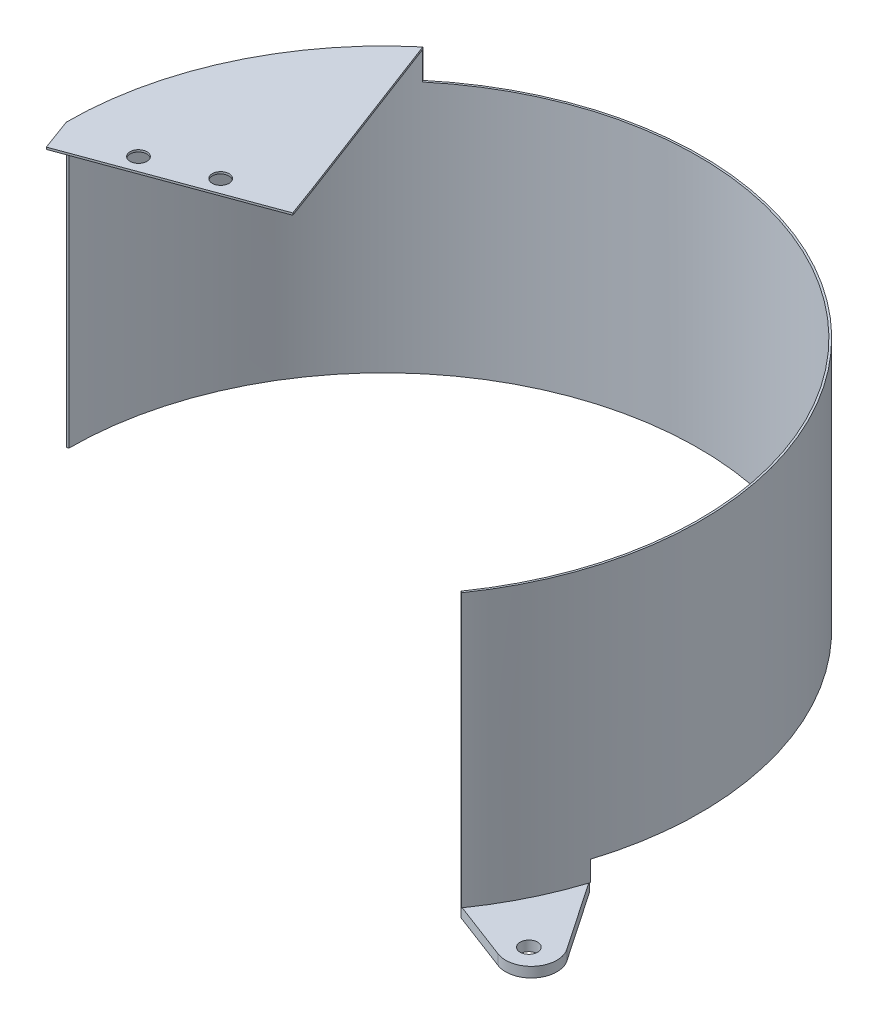
ISO-10303-21;
HEADER;
FILE_DESCRIPTION(('STEP AP214'),'2;1');
FILE_NAME('part.step','',(''),(''),'','','');
FILE_SCHEMA(('AUTOMOTIVE_DESIGN { 1 0 10303 214 1 1 1 1 }'));
ENDSEC;
DATA;
#1=APPLICATION_CONTEXT('core data for automotive mechanical design processes');
#2=APPLICATION_PROTOCOL_DEFINITION('international standard','automotive_design',2000,#1);
#3=PRODUCT_CONTEXT('',#1,'mechanical');
#4=PRODUCT('Part','Part','',(#3));
#5=PRODUCT_RELATED_PRODUCT_CATEGORY('part','',(#4));
#6=PRODUCT_DEFINITION_FORMATION('','',#4);
#7=PRODUCT_DEFINITION_CONTEXT('part definition',#1,'design');
#8=PRODUCT_DEFINITION('design','',#6,#7);
#9=PRODUCT_DEFINITION_SHAPE('','',#8);
#10=(LENGTH_UNIT() NAMED_UNIT(*) SI_UNIT(.MILLI.,.METRE.));
#11=(NAMED_UNIT(*) PLANE_ANGLE_UNIT() SI_UNIT($,.RADIAN.));
#12=(NAMED_UNIT(*) SI_UNIT($,.STERADIAN.) SOLID_ANGLE_UNIT());
#13=UNCERTAINTY_MEASURE_WITH_UNIT(LENGTH_MEASURE(1.E-05),#10,'distance_accuracy_value','');
#14=(GEOMETRIC_REPRESENTATION_CONTEXT(3) GLOBAL_UNCERTAINTY_ASSIGNED_CONTEXT((#13)) GLOBAL_UNIT_ASSIGNED_CONTEXT((#10,
#11,#12)) REPRESENTATION_CONTEXT('',''));
#15=CARTESIAN_POINT('',(0.,0.,0.));
#16=DIRECTION('',(0.,0.,1.));
#17=DIRECTION('',(1.,0.,0.));
#18=AXIS2_PLACEMENT_3D('',#15,#16,#17);
#19=CARTESIAN_POINT('',(0.,0.,0.));
#20=DIRECTION('',(0.,1.,0.));
#21=DIRECTION('',(1.,0.,0.));
#22=AXIS2_PLACEMENT_3D('',#19,#20,#21);
#23=PLANE('',#22);
#24=DIRECTION('',(-0.934811028773675,0.,-0.355145520150688));
#25=VECTOR('',#24,1.);
#26=CARTESIAN_POINT('',(97.186983651397,0.,68.0510585685711));
#27=LINE('',#26,#25);
#28=CARTESIAN_POINT('',(97.8971203298986,0.,68.3208477048796));
#29=VERTEX_POINT('',#28);
#30=CARTESIAN_POINT('',(97.186983651397,0.,68.0510585685711));
#31=VERTEX_POINT('',#30);
#32=EDGE_CURVE('E11',#29,#31,#27,.T.);
#33=ORIENTED_EDGE('',*,*,#32,.F.);
#34=CARTESIAN_POINT('',(0.,0.,0.));
#35=DIRECTION('',(0.,-1.,0.));
#36=DIRECTION('',(0.,0.,-1.));
#37=AXIS2_PLACEMENT_3D('',#34,#35,#36);
#38=CIRCLE('',#37,119.38);
#39=CARTESIAN_POINT('',(97.7903710472203,0.,68.4735549715873));
#40=VERTEX_POINT('',#39);
#41=EDGE_CURVE('E277',#29,#40,#38,.T.);
#42=ORIENTED_EDGE('',*,*,#41,.T.);
#43=DIRECTION('',(-0.819152044289029,0.,-0.573576436350992));
#44=VECTOR('',#43,1.);
#45=CARTESIAN_POINT('',(97.7903710472203,0.,68.4735549715873));
#46=LINE('',#45,#44);
#47=EDGE_CURVE('E265',#40,#31,#46,.T.);
#48=ORIENTED_EDGE('',*,*,#47,.T.);
#49=EDGE_LOOP('',(#33,#42,#48));
#50=FACE_BOUND('',#49,.T.);
#51=ADVANCED_FACE('F37',(#50),#23,.F.);
#52=DIRECTION('',(0.562477705268129,0.,0.82681245217782));
#53=VECTOR('',#52,1.);
#54=CARTESIAN_POINT('',(113.152221674402,0.,35.6767584529049));
#55=LINE('',#54,#53);
#56=CARTESIAN_POINT('',(113.152221674402,0.,35.6767584529049));
#57=VERTEX_POINT('',#56);
#58=CARTESIAN_POINT('',(113.678961298853,0.,36.4510378180639));
#59=VERTEX_POINT('',#58);
#60=EDGE_CURVE('E356',#57,#59,#55,.T.);
#61=ORIENTED_EDGE('',*,*,#60,.F.);
#62=DIRECTION('',(-0.953716950748228,0.,-0.30070579950427));
#63=VECTOR('',#62,1.);
#64=CARTESIAN_POINT('',(113.152221674402,0.,35.6767584529049));
#65=LINE('',#64,#63);
#66=CARTESIAN_POINT('',(113.854729580324,0.,35.8982583448194));
#67=VERTEX_POINT('',#66);
#68=EDGE_CURVE('E257',#57,#67,#65,.F.);
#69=ORIENTED_EDGE('',*,*,#68,.T.);
#70=EDGE_CURVE('E270',#67,#59,#38,.T.);
#71=ORIENTED_EDGE('',*,*,#70,.T.);
#72=EDGE_LOOP('',(#61,#69,#71));
#73=FACE_BOUND('',#72,.T.);
#74=ADVANCED_FACE('F383',(#73),#23,.F.);
#75=CARTESIAN_POINT('',(-119.379693575983,7.61999999999996,0.2704842037125));
#76=DIRECTION('',(0.344827586206966,0.,0.938666040607988));
#77=DIRECTION('',(0.938666040607988,0.,-0.344827586206966));
#78=AXIS2_PLACEMENT_3D('',#75,#76,#77);
#79=PLANE('',#78);
#80=DIRECTION('',(0.,-1.,0.));
#81=VECTOR('',#80,1.);
#82=CARTESIAN_POINT('',(-118.6434,102.87,0.));
#83=LINE('',#82,#81);
#84=CARTESIAN_POINT('',(-118.6434,113.03,0.));
#85=VERTEX_POINT('',#84);
#86=CARTESIAN_POINT('',(-118.6434,7.61999999999996,0.));
#87=VERTEX_POINT('',#86);
#88=EDGE_CURVE('E275',#85,#87,#83,.T.);
#89=ORIENTED_EDGE('',*,*,#88,.F.);
#90=DIRECTION('',(0.938666040607988,0.,-0.344827586206966));
#91=VECTOR('',#90,1.);
#92=CARTESIAN_POINT('',(-119.379693575983,113.03,0.270484203712493));
#93=LINE('',#92,#91);
#94=CARTESIAN_POINT('',(-119.379693575983,113.03,0.2704842037125));
#95=VERTEX_POINT('',#94);
#96=EDGE_CURVE('E61',#95,#85,#93,.T.);
#97=ORIENTED_EDGE('',*,*,#96,.F.);
#98=DIRECTION('',(0.,1.,0.));
#99=VECTOR('',#98,1.);
#100=CARTESIAN_POINT('',(-119.379693575983,7.61999999999996,0.2704842037125));
#101=LINE('',#100,#99);
#102=CARTESIAN_POINT('',(-119.379693575983,7.61999999999996,0.2704842037125));
#103=VERTEX_POINT('',#102);
#104=EDGE_CURVE('E251',#103,#95,#101,.T.);
#105=ORIENTED_EDGE('',*,*,#104,.F.);
#106=DIRECTION('',(0.938666040607988,0.,-0.344827586206966));
#107=VECTOR('',#106,1.);
#108=CARTESIAN_POINT('',(-119.379693575983,7.61999999999996,0.2704842037125));
#109=LINE('',#108,#107);
#110=EDGE_CURVE('E248',#103,#87,#109,.T.);
#111=ORIENTED_EDGE('',*,*,#110,.T.);
#112=EDGE_LOOP('',(#89,#97,#105,#111));
#113=FACE_BOUND('',#112,.T.);
#114=ADVANCED_FACE('F388',(#113),#79,.T.);
#115=CARTESIAN_POINT('',(-8.68307739513456E-12,113.03,-4.05590009722013E-12));
#116=DIRECTION('',(0.,-1.,0.));
#117=DIRECTION('',(0.,0.,-1.));
#118=AXIS2_PLACEMENT_3D('',#115,#116,#117);
#119=PLANE('',#118);
#120=DIRECTION('',(-0.354304631179803,0.,-0.935130059577032));
#121=VECTOR('',#120,1.);
#122=CARTESIAN_POINT('',(-51.440692330775,113.03,-24.6875315284033));
#123=LINE('',#122,#121);
#124=CARTESIAN_POINT('',(-76.4594448936933,113.03,-90.7205029202786));
#125=VERTEX_POINT('',#124);
#126=CARTESIAN_POINT('',(-76.7359848443851,113.03,-91.4503856195385));
#127=VERTEX_POINT('',#126);
#128=EDGE_CURVE('E46',#125,#127,#123,.T.);
#129=ORIENTED_EDGE('',*,*,#128,.F.);
#130=CARTESIAN_POINT('',(-8.68307739513456E-12,113.03,-4.05590009722013E-12));
#131=DIRECTION('',(0.,-1.,0.));
#132=DIRECTION('',(0.,0.,-1.));
#133=AXIS2_PLACEMENT_3D('',#130,#131,#132);
#134=CIRCLE('',#133,118.643399999991);
#135=CARTESIAN_POINT('',(-76.26250749109,113.03,-90.8861172827371));
#136=VERTEX_POINT('',#135);
#137=EDGE_CURVE('E237',#125,#136,#134,.T.);
#138=ORIENTED_EDGE('',*,*,#137,.T.);
#139=DIRECTION('',(-0.642787609686567,0.,-0.766044443118955));
#140=VECTOR('',#139,1.);
#141=CARTESIAN_POINT('',(-76.7359848443851,113.03,-91.4503856195385));
#142=LINE('',#141,#140);
#143=EDGE_CURVE('E236',#136,#127,#142,.T.);
#144=ORIENTED_EDGE('',*,*,#143,.T.);
#145=EDGE_LOOP('',(#129,#138,#144));
#146=FACE_BOUND('',#145,.T.);
#147=ADVANCED_FACE('F329',(#146),#119,.F.);
#148=CARTESIAN_POINT('',(0.,102.87,0.));
#149=DIRECTION('',(0.,-1.,0.));
#150=DIRECTION('',(0.,0.,-1.));
#151=AXIS2_PLACEMENT_3D('',#148,#149,#150);
#152=CYLINDRICAL_SURFACE('',#151,118.6434);
#153=CARTESIAN_POINT('',(0.,7.62,0.));
#154=DIRECTION('',(0.,-1.,0.));
#155=DIRECTION('',(0.,0.,-1.));
#156=AXIS2_PLACEMENT_3D('',#153,#154,#155);
#157=CIRCLE('',#156,118.6434);
#158=CARTESIAN_POINT('',(113.152221674402,7.62,35.6767584529046));
#159=VERTEX_POINT('',#158);
#160=EDGE_CURVE('E263',#87,#159,#157,.T.);
#161=ORIENTED_EDGE('',*,*,#160,.T.);
#162=DIRECTION('',(0.,-1.,0.));
#163=VECTOR('',#162,1.);
#164=CARTESIAN_POINT('',(113.152221674402,7.62,35.6767584529046));
#165=LINE('',#164,#163);
#166=EDGE_CURVE('E180',#159,#57,#165,.T.);
#167=ORIENTED_EDGE('',*,*,#166,.T.);
#168=DIRECTION('',(0.,1.,0.));
#169=VECTOR('',#168,1.);
#170=CARTESIAN_POINT('',(113.152221674402,-3.81,35.6767584529049));
#171=LINE('',#170,#169);
#172=CARTESIAN_POINT('',(113.152221674402,-3.81,35.6767584529049));
#173=VERTEX_POINT('',#172);
#174=EDGE_CURVE('E161',#173,#57,#171,.T.);
#175=ORIENTED_EDGE('',*,*,#174,.F.);
#176=CARTESIAN_POINT('',(-1.9595436384634E-11,-3.81,-9.67281810204668E-12));
#177=DIRECTION('',(0.,1.,0.));
#178=DIRECTION('',(0.,0.,1.));
#179=AXIS2_PLACEMENT_3D('',#176,#177,#178);
#180=CIRCLE('',#179,118.643400000022);
#181=CARTESIAN_POINT('',(97.186983651397,-3.81,68.0510585685711));
#182=VERTEX_POINT('',#181);
#183=EDGE_CURVE('E167',#182,#173,#180,.T.);
#184=ORIENTED_EDGE('',*,*,#183,.F.);
#185=DIRECTION('',(0.,1.,0.));
#186=VECTOR('',#185,1.);
#187=CARTESIAN_POINT('',(97.186983651397,-3.81,68.0510585685711));
#188=LINE('',#187,#186);
#189=EDGE_CURVE('E360',#182,#31,#188,.T.);
#190=ORIENTED_EDGE('',*,*,#189,.T.);
#191=DIRECTION('',(0.,-1.,0.));
#192=VECTOR('',#191,1.);
#193=CARTESIAN_POINT('',(97.186983651397,102.87,68.0510585685711));
#194=LINE('',#193,#192);
#195=CARTESIAN_POINT('',(97.186983651397,102.87,68.0510585685711));
#196=VERTEX_POINT('',#195);
#197=EDGE_CURVE('E284',#196,#31,#194,.T.);
#198=ORIENTED_EDGE('',*,*,#197,.F.);
#199=CARTESIAN_POINT('',(0.,102.87,0.));
#200=DIRECTION('',(0.,1.,0.));
#201=DIRECTION('',(1.,0.,0.));
#202=AXIS2_PLACEMENT_3D('',#199,#200,#201);
#203=CIRCLE('',#202,118.6434);
#204=CARTESIAN_POINT('',(-76.26250749109,102.87,-90.8861172827371));
#205=VERTEX_POINT('',#204);
#206=EDGE_CURVE('E267',#205,#196,#203,.F.);
#207=ORIENTED_EDGE('',*,*,#206,.F.);
#208=DIRECTION('',(0.,-1.,0.));
#209=VECTOR('',#208,1.);
#210=CARTESIAN_POINT('',(-76.26250749109,113.03,-90.8861172827371));
#211=LINE('',#210,#209);
#212=EDGE_CURVE('E245',#136,#205,#211,.T.);
#213=ORIENTED_EDGE('',*,*,#212,.F.);
#214=ORIENTED_EDGE('',*,*,#137,.F.);
#215=EDGE_CURVE('E233',#85,#125,#134,.T.);
#216=ORIENTED_EDGE('',*,*,#215,.F.);
#217=ORIENTED_EDGE('',*,*,#88,.T.);
#218=EDGE_LOOP('',(#161,#167,#175,#184,#190,#198,#207,#213,#214,#216,#217));
#219=FACE_BOUND('',#218,.T.);
#220=ADVANCED_FACE('F39',(#219),#152,.F.);
#221=CARTESIAN_POINT('',(0.,102.87,0.));
#222=DIRECTION('',(0.,-1.,0.));
#223=DIRECTION('',(0.,0.,-1.));
#224=AXIS2_PLACEMENT_3D('',#221,#222,#223);
#225=CYLINDRICAL_SURFACE('',#224,119.38);
#226=DIRECTION('',(0.,-1.,0.));
#227=VECTOR('',#226,1.);
#228=CARTESIAN_POINT('',(113.854729580324,102.87,35.8982583448194));
#229=LINE('',#228,#227);
#230=CARTESIAN_POINT('',(113.854729580324,7.62,35.8982583448194));
#231=VERTEX_POINT('',#230);
#232=EDGE_CURVE('E253',#231,#67,#229,.T.);
#233=ORIENTED_EDGE('',*,*,#232,.F.);
#234=CARTESIAN_POINT('',(0.,7.62,0.));
#235=DIRECTION('',(0.,-1.,0.));
#236=DIRECTION('',(0.,0.,-1.));
#237=AXIS2_PLACEMENT_3D('',#234,#235,#236);
#238=CIRCLE('',#237,119.38);
#239=EDGE_CURVE('E260',#103,#231,#238,.T.);
#240=ORIENTED_EDGE('',*,*,#239,.F.);
#241=ORIENTED_EDGE('',*,*,#104,.T.);
#242=DIRECTION('',(0.,-1.,0.));
#243=VECTOR('',#242,1.);
#244=CARTESIAN_POINT('',(-119.379693575983,113.792,0.270484203712493));
#245=LINE('',#244,#243);
#246=CARTESIAN_POINT('',(-119.379693575983,113.792,0.2704842037125));
#247=VERTEX_POINT('',#246);
#248=EDGE_CURVE('E203',#247,#95,#245,.T.);
#249=ORIENTED_EDGE('',*,*,#248,.F.);
#250=CARTESIAN_POINT('',(-8.00748356510894E-12,113.792,-3.740063814206E-12));
#251=DIRECTION('',(0.,1.,0.));
#252=DIRECTION('',(0.,0.,-1.));
#253=AXIS2_PLACEMENT_3D('',#250,#251,#252);
#254=CIRCLE('',#253,119.379999999992);
#255=CARTESIAN_POINT('',(-76.7359848443851,113.792,-91.4503856195385));
#256=VERTEX_POINT('',#255);
#257=EDGE_CURVE('E219',#256,#247,#254,.T.);
#258=ORIENTED_EDGE('',*,*,#257,.F.);
#259=DIRECTION('',(0.,-1.,0.));
#260=VECTOR('',#259,1.);
#261=CARTESIAN_POINT('',(-76.7359848443851,113.792,-91.4503856195385));
#262=LINE('',#261,#260);
#263=EDGE_CURVE('E224',#256,#127,#262,.T.);
#264=ORIENTED_EDGE('',*,*,#263,.T.);
#265=DIRECTION('',(0.,-1.,0.));
#266=VECTOR('',#265,1.);
#267=CARTESIAN_POINT('',(-76.7359848443851,113.03,-91.4503856195385));
#268=LINE('',#267,#266);
#269=CARTESIAN_POINT('',(-76.7359848443851,102.87,-91.4503856195385));
#270=VERTEX_POINT('',#269);
#271=EDGE_CURVE('E240',#127,#270,#268,.T.);
#272=ORIENTED_EDGE('',*,*,#271,.T.);
#273=CARTESIAN_POINT('',(0.,102.87,0.));
#274=DIRECTION('',(0.,-1.,0.));
#275=DIRECTION('',(0.,0.,-1.));
#276=AXIS2_PLACEMENT_3D('',#273,#274,#275);
#277=CIRCLE('',#276,119.38);
#278=CARTESIAN_POINT('',(97.7903710472203,102.87,68.4735549715873));
#279=VERTEX_POINT('',#278);
#280=EDGE_CURVE('E273',#270,#279,#277,.T.);
#281=ORIENTED_EDGE('',*,*,#280,.T.);
#282=DIRECTION('',(0.,-1.,0.));
#283=VECTOR('',#282,1.);
#284=CARTESIAN_POINT('',(97.7903710472203,102.87,68.4735549715873));
#285=LINE('',#284,#283);
#286=EDGE_CURVE('E281',#279,#40,#285,.T.);
#287=ORIENTED_EDGE('',*,*,#286,.T.);
#288=ORIENTED_EDGE('',*,*,#41,.F.);
#289=EDGE_CURVE('E279',#59,#29,#38,.T.);
#290=ORIENTED_EDGE('',*,*,#289,.F.);
#291=ORIENTED_EDGE('',*,*,#70,.F.);
#292=EDGE_LOOP('',(#233,#240,#241,#249,#258,#264,#272,#281,#287,#288,#290,#291));
#293=FACE_BOUND('',#292,.T.);
#294=ADVANCED_FACE('F322',(#293),#225,.T.);
#295=CARTESIAN_POINT('',(97.7903710472203,102.87,68.4735549715873));
#296=DIRECTION('',(-0.573576436350992,0.,0.81915204428903));
#297=DIRECTION('',(0.81915204428903,0.,0.573576436350992));
#298=AXIS2_PLACEMENT_3D('',#295,#296,#297);
#299=PLANE('',#298);
#300=ORIENTED_EDGE('',*,*,#47,.F.);
#301=ORIENTED_EDGE('',*,*,#286,.F.);
#302=DIRECTION('',(-0.819152044289029,0.,-0.573576436350992));
#303=VECTOR('',#302,1.);
#304=CARTESIAN_POINT('',(97.7903710472203,102.87,68.4735549715873));
#305=LINE('',#304,#303);
#306=EDGE_CURVE('E269',#279,#196,#305,.T.);
#307=ORIENTED_EDGE('',*,*,#306,.T.);
#308=ORIENTED_EDGE('',*,*,#197,.T.);
#309=EDGE_LOOP('',(#300,#301,#307,#308));
#310=FACE_BOUND('',#309,.T.);
#311=ADVANCED_FACE('F339',(#310),#299,.T.);
#312=CARTESIAN_POINT('',(0.,102.87,0.));
#313=DIRECTION('',(0.,1.,0.));
#314=DIRECTION('',(1.,0.,0.));
#315=AXIS2_PLACEMENT_3D('',#312,#313,#314);
#316=PLANE('',#315);
#317=DIRECTION('',(-0.642787609686567,0.,-0.766044443118955));
#318=VECTOR('',#317,1.);
#319=CARTESIAN_POINT('',(-76.7359848443851,102.87,-91.4503856195385));
#320=LINE('',#319,#318);
#321=EDGE_CURVE('E232',#205,#270,#320,.T.);
#322=ORIENTED_EDGE('',*,*,#321,.F.);
#323=ORIENTED_EDGE('',*,*,#206,.T.);
#324=ORIENTED_EDGE('',*,*,#306,.F.);
#325=ORIENTED_EDGE('',*,*,#280,.F.);
#326=EDGE_LOOP('',(#322,#323,#324,#325));
#327=FACE_BOUND('',#326,.T.);
#328=ADVANCED_FACE('F336',(#327),#316,.T.);
#329=CARTESIAN_POINT('',(0.,7.62,0.));
#330=DIRECTION('',(0.,1.,0.));
#331=DIRECTION('',(0.,0.,1.));
#332=AXIS2_PLACEMENT_3D('',#329,#330,#331);
#333=PLANE('',#332);
#334=ORIENTED_EDGE('',*,*,#160,.F.);
#335=ORIENTED_EDGE('',*,*,#110,.F.);
#336=ORIENTED_EDGE('',*,*,#239,.T.);
#337=DIRECTION('',(-0.953716950748229,0.,-0.300705799504267));
#338=VECTOR('',#337,1.);
#339=CARTESIAN_POINT('',(113.152221674402,7.62,35.6767584529046));
#340=LINE('',#339,#338);
#341=EDGE_CURVE('E255',#159,#231,#340,.F.);
#342=ORIENTED_EDGE('',*,*,#341,.F.);
#343=EDGE_LOOP('',(#334,#335,#336,#342));
#344=FACE_BOUND('',#343,.T.);
#345=ADVANCED_FACE('F398',(#344),#333,.F.);
#346=CARTESIAN_POINT('',(113.152221674402,3.81,35.6767584529046));
#347=DIRECTION('',(-0.300705799504267,0.,0.953716950748229));
#348=DIRECTION('',(0.,-1.,0.));
#349=AXIS2_PLACEMENT_3D('',#346,#347,#348);
#350=PLANE('',#349);
#351=ORIENTED_EDGE('',*,*,#68,.F.);
#352=ORIENTED_EDGE('',*,*,#166,.F.);
#353=ORIENTED_EDGE('',*,*,#341,.T.);
#354=ORIENTED_EDGE('',*,*,#232,.T.);
#355=EDGE_LOOP('',(#351,#352,#353,#354));
#356=FACE_BOUND('',#355,.T.);
#357=ADVANCED_FACE('F402',(#356),#350,.F.);
#358=CARTESIAN_POINT('',(-76.7359848443851,113.03,-91.4503856195385));
#359=DIRECTION('',(-0.766044443118955,0.,0.642787609686567));
#360=DIRECTION('',(0.642787609686567,0.,0.766044443118955));
#361=AXIS2_PLACEMENT_3D('',#358,#359,#360);
#362=PLANE('',#361);
#363=ORIENTED_EDGE('',*,*,#321,.T.);
#364=ORIENTED_EDGE('',*,*,#271,.F.);
#365=ORIENTED_EDGE('',*,*,#143,.F.);
#366=ORIENTED_EDGE('',*,*,#212,.T.);
#367=EDGE_LOOP('',(#363,#364,#365,#366));
#368=FACE_BOUND('',#367,.T.);
#369=ADVANCED_FACE('F327',(#368),#362,.F.);
#370=CARTESIAN_POINT('',(-51.440692330775,113.792,-24.6875315284033));
#371=DIRECTION('',(-0.935130059577032,0.,0.354304631179803));
#372=DIRECTION('',(0.354304631179803,0.,0.935130059577032));
#373=AXIS2_PLACEMENT_3D('',#370,#371,#372);
#374=PLANE('',#373);
#375=CARTESIAN_POINT('',(-51.440692330775,113.03,-24.6875315284033));
#376=VERTEX_POINT('',#375);
#377=EDGE_CURVE('E218',#376,#125,#123,.T.);
#378=ORIENTED_EDGE('',*,*,#377,.T.);
#379=ORIENTED_EDGE('',*,*,#128,.T.);
#380=ORIENTED_EDGE('',*,*,#263,.F.);
#381=DIRECTION('',(-0.354304631179803,0.,-0.935130059577032));
#382=VECTOR('',#381,1.);
#383=CARTESIAN_POINT('',(-51.440692330775,113.792,-24.6875315284033));
#384=LINE('',#383,#382);
#385=CARTESIAN_POINT('',(-51.440692330775,113.792,-24.6875315284033));
#386=VERTEX_POINT('',#385);
#387=EDGE_CURVE('E222',#386,#256,#384,.T.);
#388=ORIENTED_EDGE('',*,*,#387,.F.);
#389=DIRECTION('',(0.,-1.,0.));
#390=VECTOR('',#389,1.);
#391=CARTESIAN_POINT('',(-51.440692330775,113.792,-24.6875315284033));
#392=LINE('',#391,#390);
#393=EDGE_CURVE('E229',#386,#376,#392,.T.);
#394=ORIENTED_EDGE('',*,*,#393,.T.);
#395=EDGE_LOOP('',(#378,#379,#380,#388,#394));
#396=FACE_BOUND('',#395,.T.);
#397=ADVANCED_FACE('F307',(#396),#374,.F.);
#398=CARTESIAN_POINT('',(-8.00748356510894E-12,113.792,-3.740063814206E-12));
#399=DIRECTION('',(0.,-1.,0.));
#400=DIRECTION('',(0.,0.,-1.));
#401=AXIS2_PLACEMENT_3D('',#398,#399,#400);
#402=PLANE('',#401);
#403=CARTESIAN_POINT('',(-94.5400268436977,113.792,-2.08967609360086));
#404=DIRECTION('',(0.,1.,0.));
#405=DIRECTION('',(0.,0.,1.));
#406=AXIS2_PLACEMENT_3D('',#403,#404,#405);
#407=CIRCLE('',#406,3.175);
#408=CARTESIAN_POINT('',(-94.5400268436977,113.792,1.08532390639914));
#409=VERTEX_POINT('',#408);
#410=EDGE_CURVE('E184',#409,#409,#407,.T.);
#411=ORIENTED_EDGE('',*,*,#410,.F.);
#412=EDGE_LOOP('',(#411));
#413=FACE_BOUND('',#412,.T.);
#414=CARTESIAN_POINT('',(-71.890015283827,113.792,-10.4103657487749));
#415=DIRECTION('',(0.,1.,0.));
#416=DIRECTION('',(0.,0.,1.));
#417=AXIS2_PLACEMENT_3D('',#414,#415,#416);
#418=CIRCLE('',#417,3.175);
#419=CARTESIAN_POINT('',(-71.890015283827,113.792,-7.23536574877494));
#420=VERTEX_POINT('',#419);
#421=EDGE_CURVE('E181',#420,#420,#418,.T.);
#422=ORIENTED_EDGE('',*,*,#421,.F.);
#423=EDGE_LOOP('',(#422));
#424=FACE_BOUND('',#423,.T.);
#425=ORIENTED_EDGE('',*,*,#257,.T.);
#426=DIRECTION('',(-0.344827586206966,0.,-0.938666040607988));
#427=VECTOR('',#426,1.);
#428=CARTESIAN_POINT('',(-115.000383231154,113.792,12.1915429194339));
#429=LINE('',#428,#427);
#430=CARTESIAN_POINT('',(-115.000383231154,113.792,12.1915429194339));
#431=VERTEX_POINT('',#430);
#432=EDGE_CURVE('E202',#431,#247,#429,.T.);
#433=ORIENTED_EDGE('',*,*,#432,.F.);
#434=DIRECTION('',(-0.938666040607988,0.,0.344827586206966));
#435=VECTOR('',#434,1.);
#436=CARTESIAN_POINT('',(-115.000383231154,113.792,12.1915429194339));
#437=LINE('',#436,#435);
#438=CARTESIAN_POINT('',(-47.0613819859465,113.792,-12.7664728126818));
#439=VERTEX_POINT('',#438);
#440=EDGE_CURVE('E200',#439,#431,#437,.T.);
#441=ORIENTED_EDGE('',*,*,#440,.F.);
#442=DIRECTION('',(-0.344827586206966,0.,-0.938666040607988));
#443=VECTOR('',#442,1.);
#444=CARTESIAN_POINT('',(-47.0613819859465,113.792,-12.7664728126818));
#445=LINE('',#444,#443);
#446=EDGE_CURVE('E209',#439,#386,#445,.T.);
#447=ORIENTED_EDGE('',*,*,#446,.T.);
#448=ORIENTED_EDGE('',*,*,#387,.T.);
#449=EDGE_LOOP('',(#425,#433,#441,#447,#448));
#450=FACE_BOUND('',#449,.T.);
#451=ADVANCED_FACE('F298',(#413,#424,#450),#402,.F.);
#452=CARTESIAN_POINT('',(-8.00748356510894E-12,113.03,-3.740063814206E-12));
#453=DIRECTION('',(0.,-1.,0.));
#454=DIRECTION('',(0.,0.,-1.));
#455=AXIS2_PLACEMENT_3D('',#452,#453,#454);
#456=PLANE('',#455);
#457=CARTESIAN_POINT('',(-94.5400268436977,113.03,-2.08967609360086));
#458=DIRECTION('',(0.,-1.,0.));
#459=DIRECTION('',(0.,0.,-1.));
#460=AXIS2_PLACEMENT_3D('',#457,#458,#459);
#461=CIRCLE('',#460,3.175);
#462=CARTESIAN_POINT('',(-94.5400268436977,113.03,-5.26467609360085));
#463=VERTEX_POINT('',#462);
#464=EDGE_CURVE('E41',#463,#463,#461,.T.);
#465=ORIENTED_EDGE('',*,*,#464,.F.);
#466=EDGE_LOOP('',(#465));
#467=FACE_BOUND('',#466,.T.);
#468=CARTESIAN_POINT('',(-71.890015283827,113.03,-10.4103657487749));
#469=DIRECTION('',(0.,-1.,0.));
#470=DIRECTION('',(0.,0.,-1.));
#471=AXIS2_PLACEMENT_3D('',#468,#469,#470);
#472=CIRCLE('',#471,3.175);
#473=CARTESIAN_POINT('',(-71.890015283827,113.03,-13.5853657487749));
#474=VERTEX_POINT('',#473);
#475=EDGE_CURVE('E191',#474,#474,#472,.T.);
#476=ORIENTED_EDGE('',*,*,#475,.F.);
#477=EDGE_LOOP('',(#476));
#478=FACE_BOUND('',#477,.T.);
#479=ORIENTED_EDGE('',*,*,#377,.F.);
#480=DIRECTION('',(-0.344827586206966,0.,-0.938666040607988));
#481=VECTOR('',#480,1.);
#482=CARTESIAN_POINT('',(-47.0613819859465,113.03,-12.7664728126818));
#483=LINE('',#482,#481);
#484=CARTESIAN_POINT('',(-47.0613819859465,113.03,-12.7664728126818));
#485=VERTEX_POINT('',#484);
#486=EDGE_CURVE('E212',#485,#376,#483,.T.);
#487=ORIENTED_EDGE('',*,*,#486,.F.);
#488=DIRECTION('',(0.938666040607988,0.,-0.344827586206966));
#489=VECTOR('',#488,1.);
#490=CARTESIAN_POINT('',(-115.000383231154,113.03,12.1915429194339));
#491=LINE('',#490,#489);
#492=CARTESIAN_POINT('',(-115.000383231154,113.03,12.1915429194339));
#493=VERTEX_POINT('',#492);
#494=EDGE_CURVE('E196',#493,#485,#491,.T.);
#495=ORIENTED_EDGE('',*,*,#494,.F.);
#496=DIRECTION('',(-0.344827586206966,0.,-0.938666040607988));
#497=VECTOR('',#496,1.);
#498=CARTESIAN_POINT('',(-115.000383231154,113.03,12.1915429194339));
#499=LINE('',#498,#497);
#500=EDGE_CURVE('E215',#493,#95,#499,.T.);
#501=ORIENTED_EDGE('',*,*,#500,.T.);
#502=ORIENTED_EDGE('',*,*,#96,.T.);
#503=ORIENTED_EDGE('',*,*,#215,.T.);
#504=EDGE_LOOP('',(#479,#487,#495,#501,#502,#503));
#505=FACE_BOUND('',#504,.T.);
#506=ADVANCED_FACE('F294',(#467,#478,#505),#456,.T.);
#507=CARTESIAN_POINT('',(-115.000383231154,113.792,12.1915429194339));
#508=DIRECTION('',(0.938666040607988,0.,-0.344827586206966));
#509=DIRECTION('',(-0.344827586206966,0.,-0.938666040607988));
#510=AXIS2_PLACEMENT_3D('',#507,#508,#509);
#511=PLANE('',#510);
#512=ORIENTED_EDGE('',*,*,#248,.T.);
#513=ORIENTED_EDGE('',*,*,#500,.F.);
#514=DIRECTION('',(0.,-1.,0.));
#515=VECTOR('',#514,1.);
#516=CARTESIAN_POINT('',(-115.000383231154,113.792,12.1915429194339));
#517=LINE('',#516,#515);
#518=EDGE_CURVE('E193',#431,#493,#517,.T.);
#519=ORIENTED_EDGE('',*,*,#518,.F.);
#520=ORIENTED_EDGE('',*,*,#432,.T.);
#521=EDGE_LOOP('',(#512,#513,#519,#520));
#522=FACE_BOUND('',#521,.T.);
#523=ADVANCED_FACE('F297',(#522),#511,.F.);
#524=CARTESIAN_POINT('',(-47.0613819859465,113.792,-12.7664728126818));
#525=DIRECTION('',(-0.938666040607988,0.,0.344827586206966));
#526=DIRECTION('',(0.344827586206966,0.,0.938666040607988));
#527=AXIS2_PLACEMENT_3D('',#524,#525,#526);
#528=PLANE('',#527);
#529=ORIENTED_EDGE('',*,*,#393,.F.);
#530=ORIENTED_EDGE('',*,*,#446,.F.);
#531=DIRECTION('',(0.,1.,0.));
#532=VECTOR('',#531,1.);
#533=CARTESIAN_POINT('',(-47.0613819859465,113.792,-12.7664728126818));
#534=LINE('',#533,#532);
#535=EDGE_CURVE('E198',#485,#439,#534,.T.);
#536=ORIENTED_EDGE('',*,*,#535,.F.);
#537=ORIENTED_EDGE('',*,*,#486,.T.);
#538=EDGE_LOOP('',(#529,#530,#536,#537));
#539=FACE_BOUND('',#538,.T.);
#540=ADVANCED_FACE('F311',(#539),#528,.F.);
#541=CARTESIAN_POINT('',(-9.72810939358385,0.,-26.4811931885172));
#542=DIRECTION('',(0.344827586206966,0.,0.938666040607989));
#543=DIRECTION('',(0.938666040607989,0.,-0.344827586206966));
#544=AXIS2_PLACEMENT_3D('',#541,#542,#543);
#545=PLANE('',#544);
#546=ORIENTED_EDGE('',*,*,#518,.T.);
#547=ORIENTED_EDGE('',*,*,#494,.T.);
#548=ORIENTED_EDGE('',*,*,#535,.T.);
#549=ORIENTED_EDGE('',*,*,#440,.T.);
#550=EDGE_LOOP('',(#546,#547,#548,#549));
#551=FACE_BOUND('',#550,.T.);
#552=ADVANCED_FACE('F314',(#551),#545,.T.);
#553=CARTESIAN_POINT('',(-71.890015283827,0.,-10.4103657487749));
#554=DIRECTION('',(0.,1.,0.));
#555=DIRECTION('',(0.,0.,1.));
#556=AXIS2_PLACEMENT_3D('',#553,#554,#555);
#557=CYLINDRICAL_SURFACE('',#556,3.175);
#558=ORIENTED_EDGE('',*,*,#475,.T.);
#559=EDGE_LOOP('',(#558));
#560=FACE_BOUND('',#559,.T.);
#561=ORIENTED_EDGE('',*,*,#421,.T.);
#562=EDGE_LOOP('',(#561));
#563=FACE_BOUND('',#562,.T.);
#564=ADVANCED_FACE('F428',(#560,#563),#557,.F.);
#565=CARTESIAN_POINT('',(-94.5400268436977,0.,-2.08967609360086));
#566=DIRECTION('',(0.,1.,0.));
#567=DIRECTION('',(0.,0.,1.));
#568=AXIS2_PLACEMENT_3D('',#565,#566,#567);
#569=CYLINDRICAL_SURFACE('',#568,3.175);
#570=ORIENTED_EDGE('',*,*,#464,.T.);
#571=EDGE_LOOP('',(#570));
#572=FACE_BOUND('',#571,.T.);
#573=ORIENTED_EDGE('',*,*,#410,.T.);
#574=EDGE_LOOP('',(#573));
#575=FACE_BOUND('',#574,.T.);
#576=ADVANCED_FACE('F291',(#572,#575),#569,.F.);
#577=CARTESIAN_POINT('',(-1.9595436384634E-11,-3.81,-9.67281810204668E-12));
#578=DIRECTION('',(0.,1.,0.));
#579=DIRECTION('',(0.,0.,1.));
#580=AXIS2_PLACEMENT_3D('',#577,#578,#579);
#581=PLANE('',#580);
#582=ORIENTED_EDGE('',*,*,#183,.T.);
#583=DIRECTION('',(0.562477705268129,0.,0.82681245217782));
#584=VECTOR('',#583,1.);
#585=CARTESIAN_POINT('',(113.152221674402,-3.81,35.6767584529049));
#586=LINE('',#585,#584);
#587=CARTESIAN_POINT('',(131.182568859998,-3.81,62.1804143854251));
#588=VERTEX_POINT('',#587);
#589=EDGE_CURVE('E156',#173,#588,#586,.T.);
#590=ORIENTED_EDGE('',*,*,#589,.T.);
#591=CARTESIAN_POINT('',(123.202175071578,-3.81,67.6094491966731));
#592=DIRECTION('',(0.,-1.,0.));
#593=DIRECTION('',(0.,0.,-1.));
#594=AXIS2_PLACEMENT_3D('',#591,#592,#593);
#595=CIRCLE('',#594,9.65200000000001);
#596=CARTESIAN_POINT('',(119.774310511083,-3.81,76.6322452463966));
#597=VERTEX_POINT('',#596);
#598=EDGE_CURVE('E166',#588,#597,#595,.T.);
#599=ORIENTED_EDGE('',*,*,#598,.T.);
#600=DIRECTION('',(-0.934811028773675,0.,-0.355145520150688));
#601=VECTOR('',#600,1.);
#602=CARTESIAN_POINT('',(97.186983651397,-3.81,68.0510585685711));
#603=LINE('',#602,#601);
#604=EDGE_CURVE('E173',#597,#182,#603,.T.);
#605=ORIENTED_EDGE('',*,*,#604,.T.);
#606=EDGE_LOOP('',(#582,#590,#599,#605));
#607=FACE_BOUND('',#606,.T.);
#608=CARTESIAN_POINT('',(123.308075213921,-3.81,68.6202112821195));
#609=DIRECTION('',(0.,-1.,0.));
#610=DIRECTION('',(0.,0.,-1.));
#611=AXIS2_PLACEMENT_3D('',#608,#609,#610);
#612=CIRCLE('',#611,3.29999999999998);
#613=CARTESIAN_POINT('',(123.308075213921,-3.81,65.3202112821195));
#614=VERTEX_POINT('',#613);
#615=EDGE_CURVE('E363',#614,#614,#612,.T.);
#616=ORIENTED_EDGE('',*,*,#615,.F.);
#617=EDGE_LOOP('',(#616));
#618=FACE_BOUND('',#617,.T.);
#619=ADVANCED_FACE('F170',(#607,#618),#581,.F.);
#620=CARTESIAN_POINT('',(-1.9595436384634E-11,0.,-9.67281810204668E-12));
#621=DIRECTION('',(0.,1.,0.));
#622=DIRECTION('',(0.,0.,1.));
#623=AXIS2_PLACEMENT_3D('',#620,#621,#622);
#624=PLANE('',#623);
#625=CARTESIAN_POINT('',(131.182568859998,0.,62.1804143854251));
#626=VERTEX_POINT('',#625);
#627=EDGE_CURVE('E350',#59,#626,#55,.T.);
#628=ORIENTED_EDGE('',*,*,#627,.F.);
#629=ORIENTED_EDGE('',*,*,#289,.T.);
#630=CARTESIAN_POINT('',(119.774310511083,0.,76.6322452463966));
#631=VERTEX_POINT('',#630);
#632=EDGE_CURVE('E48',#631,#29,#27,.T.);
#633=ORIENTED_EDGE('',*,*,#632,.F.);
#634=CARTESIAN_POINT('',(123.202175071578,0.,67.6094491966731));
#635=DIRECTION('',(0.,-1.,0.));
#636=DIRECTION('',(0.,0.,-1.));
#637=AXIS2_PLACEMENT_3D('',#634,#635,#636);
#638=CIRCLE('',#637,9.65200000000001);
#639=EDGE_CURVE('E355',#626,#631,#638,.T.);
#640=ORIENTED_EDGE('',*,*,#639,.F.);
#641=EDGE_LOOP('',(#628,#629,#633,#640));
#642=FACE_BOUND('',#641,.T.);
#643=CARTESIAN_POINT('',(123.308075213921,0.,68.6202112821195));
#644=DIRECTION('',(0.,-1.,0.));
#645=DIRECTION('',(0.,0.,-1.));
#646=AXIS2_PLACEMENT_3D('',#643,#644,#645);
#647=CIRCLE('',#646,3.29999999999998);
#648=CARTESIAN_POINT('',(123.308075213921,0.,65.3202112821195));
#649=VERTEX_POINT('',#648);
#650=EDGE_CURVE('E365',#649,#649,#647,.T.);
#651=ORIENTED_EDGE('',*,*,#650,.T.);
#652=EDGE_LOOP('',(#651));
#653=FACE_BOUND('',#652,.T.);
#654=ADVANCED_FACE('F347',(#642,#653),#624,.T.);
#655=CARTESIAN_POINT('',(113.152221674402,-3.81,35.6767584529049));
#656=DIRECTION('',(-0.82681245217782,0.,0.562477705268129));
#657=DIRECTION('',(0.562477705268129,0.,0.82681245217782));
#658=AXIS2_PLACEMENT_3D('',#655,#656,#657);
#659=PLANE('',#658);
#660=ORIENTED_EDGE('',*,*,#60,.T.);
#661=ORIENTED_EDGE('',*,*,#627,.T.);
#662=DIRECTION('',(0.,1.,0.));
#663=VECTOR('',#662,1.);
#664=CARTESIAN_POINT('',(131.182568859998,-3.81,62.1804143854251));
#665=LINE('',#664,#663);
#666=EDGE_CURVE('E163',#588,#626,#665,.T.);
#667=ORIENTED_EDGE('',*,*,#666,.F.);
#668=ORIENTED_EDGE('',*,*,#589,.F.);
#669=ORIENTED_EDGE('',*,*,#174,.T.);
#670=EDGE_LOOP('',(#660,#661,#667,#668,#669));
#671=FACE_BOUND('',#670,.T.);
#672=ADVANCED_FACE('F159',(#671),#659,.F.);
#673=CARTESIAN_POINT('',(123.202175071578,-3.81,67.6094491966731));
#674=DIRECTION('',(0.,1.,0.));
#675=DIRECTION('',(0.,0.,1.));
#676=AXIS2_PLACEMENT_3D('',#673,#674,#675);
#677=CYLINDRICAL_SURFACE('',#676,9.65200000000001);
#678=ORIENTED_EDGE('',*,*,#639,.T.);
#679=DIRECTION('',(0.,1.,0.));
#680=VECTOR('',#679,1.);
#681=CARTESIAN_POINT('',(119.774310511083,-3.81,76.6322452463966));
#682=LINE('',#681,#680);
#683=EDGE_CURVE('E186',#597,#631,#682,.T.);
#684=ORIENTED_EDGE('',*,*,#683,.F.);
#685=ORIENTED_EDGE('',*,*,#598,.F.);
#686=ORIENTED_EDGE('',*,*,#666,.T.);
#687=EDGE_LOOP('',(#678,#684,#685,#686));
#688=FACE_BOUND('',#687,.T.);
#689=ADVANCED_FACE('F379',(#688),#677,.T.);
#690=CARTESIAN_POINT('',(97.186983651397,-3.81,68.0510585685711));
#691=DIRECTION('',(0.355145520150688,0.,-0.934811028773675));
#692=DIRECTION('',(-0.934811028773675,0.,-0.355145520150688));
#693=AXIS2_PLACEMENT_3D('',#690,#691,#692);
#694=PLANE('',#693);
#695=ORIENTED_EDGE('',*,*,#632,.T.);
#696=ORIENTED_EDGE('',*,*,#32,.T.);
#697=ORIENTED_EDGE('',*,*,#189,.F.);
#698=ORIENTED_EDGE('',*,*,#604,.F.);
#699=ORIENTED_EDGE('',*,*,#683,.T.);
#700=EDGE_LOOP('',(#695,#696,#697,#698,#699));
#701=FACE_BOUND('',#700,.T.);
#702=ADVANCED_FACE('F353',(#701),#694,.F.);
#703=CARTESIAN_POINT('',(123.308075213921,-3.81,68.6202112821195));
#704=DIRECTION('',(0.,1.,0.));
#705=DIRECTION('',(0.,0.,1.));
#706=AXIS2_PLACEMENT_3D('',#703,#704,#705);
#707=CYLINDRICAL_SURFACE('',#706,3.29999999999998);
#708=ORIENTED_EDGE('',*,*,#650,.F.);
#709=EDGE_LOOP('',(#708));
#710=FACE_BOUND('',#709,.T.);
#711=ORIENTED_EDGE('',*,*,#615,.T.);
#712=EDGE_LOOP('',(#711));
#713=FACE_BOUND('',#712,.T.);
#714=ADVANCED_FACE('F373',(#710,#713),#707,.F.);
#715=CLOSED_SHELL('',(#51,#74,#114,#147,#220,#294,#311,#328,#345,#357,#369,#397,#451,#506,#523,
#540,#552,#564,#576,#619,#654,#672,#689,#702,#714));
#716=MANIFOLD_SOLID_BREP('B2',#715);
#717=ADVANCED_BREP_SHAPE_REPRESENTATION('',(#18,#716),#14);
#718=SHAPE_DEFINITION_REPRESENTATION(#9,#717);
ENDSEC;
END-ISO-10303-21;
